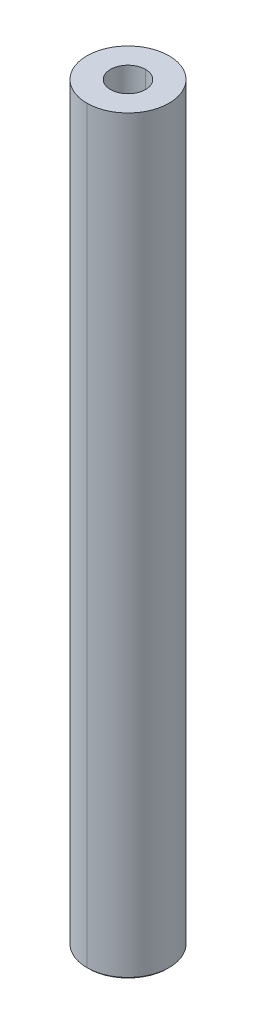
ISO-10303-21;
HEADER;
FILE_DESCRIPTION(('STEP AP214'),'2;1');
FILE_NAME('part.step','',(''),(''),'','','');
FILE_SCHEMA(('AUTOMOTIVE_DESIGN { 1 0 10303 214 1 1 1 1 }'));
ENDSEC;
DATA;
#1=APPLICATION_CONTEXT('core data for automotive mechanical design processes');
#2=APPLICATION_PROTOCOL_DEFINITION('international standard','automotive_design',2000,#1);
#3=PRODUCT_CONTEXT('',#1,'mechanical');
#4=PRODUCT('Part','Part','',(#3));
#5=PRODUCT_RELATED_PRODUCT_CATEGORY('part','',(#4));
#6=PRODUCT_DEFINITION_FORMATION('','',#4);
#7=PRODUCT_DEFINITION_CONTEXT('part definition',#1,'design');
#8=PRODUCT_DEFINITION('design','',#6,#7);
#9=PRODUCT_DEFINITION_SHAPE('','',#8);
#10=(LENGTH_UNIT() NAMED_UNIT(*) SI_UNIT(.MILLI.,.METRE.));
#11=(NAMED_UNIT(*) PLANE_ANGLE_UNIT() SI_UNIT($,.RADIAN.));
#12=(NAMED_UNIT(*) SI_UNIT($,.STERADIAN.) SOLID_ANGLE_UNIT());
#13=UNCERTAINTY_MEASURE_WITH_UNIT(LENGTH_MEASURE(1.E-05),#10,'distance_accuracy_value','');
#14=(GEOMETRIC_REPRESENTATION_CONTEXT(3) GLOBAL_UNCERTAINTY_ASSIGNED_CONTEXT((#13)) GLOBAL_UNIT_ASSIGNED_CONTEXT((#10,
#11,#12)) REPRESENTATION_CONTEXT('',''));
#15=CARTESIAN_POINT('',(0.,0.,0.));
#16=DIRECTION('',(0.,0.,1.));
#17=DIRECTION('',(1.,0.,0.));
#18=AXIS2_PLACEMENT_3D('',#15,#16,#17);
#19=CARTESIAN_POINT('',(0.,63.5,0.));
#20=DIRECTION('',(0.,-1.,0.));
#21=DIRECTION('',(0.,0.,-1.));
#22=AXIS2_PLACEMENT_3D('',#19,#20,#21);
#23=CYLINDRICAL_SURFACE('',#22,3.17119);
#24=DIRECTION('',(0.,-1.,0.));
#25=VECTOR('',#24,1.);
#26=CARTESIAN_POINT('',(0.,63.5,-3.17119));
#27=LINE('',#26,#25);
#28=CARTESIAN_POINT('',(0.,57.94,-3.17119));
#29=VERTEX_POINT('',#28);
#30=CARTESIAN_POINT('',(0.,0.127000000000002,-3.17119));
#31=VERTEX_POINT('',#30);
#32=EDGE_CURVE('E191',#29,#31,#27,.T.);
#33=ORIENTED_EDGE('',*,*,#32,.F.);
#34=CARTESIAN_POINT('',(0.,57.94,0.));
#35=DIRECTION('',(0.,1.,0.));
#36=DIRECTION('',(0.,0.,1.));
#37=AXIS2_PLACEMENT_3D('',#34,#35,#36);
#38=CIRCLE('',#37,3.17119);
#39=CARTESIAN_POINT('',(0.,57.94,3.17119));
#40=VERTEX_POINT('',#39);
#41=EDGE_CURVE('E52',#29,#40,#38,.F.);
#42=ORIENTED_EDGE('',*,*,#41,.T.);
#43=DIRECTION('',(0.,-1.,0.));
#44=VECTOR('',#43,1.);
#45=CARTESIAN_POINT('',(0.,63.5,3.17119));
#46=LINE('',#45,#44);
#47=CARTESIAN_POINT('',(0.,0.127000000000002,3.17119));
#48=VERTEX_POINT('',#47);
#49=EDGE_CURVE('E147',#40,#48,#46,.T.);
#50=ORIENTED_EDGE('',*,*,#49,.T.);
#51=CARTESIAN_POINT('',(0.,0.127000000000002,0.));
#52=DIRECTION('',(0.,1.,0.));
#53=DIRECTION('',(0.,0.,1.));
#54=AXIS2_PLACEMENT_3D('',#51,#52,#53);
#55=CIRCLE('',#54,3.17119);
#56=EDGE_CURVE('E141',#48,#31,#55,.T.);
#57=ORIENTED_EDGE('',*,*,#56,.T.);
#58=EDGE_LOOP('',(#33,#42,#50,#57));
#59=FACE_BOUND('',#58,.T.);
#60=ADVANCED_FACE('F38',(#59),#23,.T.);
#61=CARTESIAN_POINT('',(0.,63.5,0.));
#62=DIRECTION('',(0.,-1.,0.));
#63=DIRECTION('',(0.,0.,-1.));
#64=AXIS2_PLACEMENT_3D('',#61,#62,#63);
#65=CYLINDRICAL_SURFACE('',#64,3.17119);
#66=ORIENTED_EDGE('',*,*,#49,.F.);
#67=CARTESIAN_POINT('',(0.,57.94,0.));
#68=DIRECTION('',(0.,1.,0.));
#69=DIRECTION('',(0.,0.,1.));
#70=AXIS2_PLACEMENT_3D('',#67,#68,#69);
#71=CIRCLE('',#70,3.17119);
#72=EDGE_CURVE('E120',#40,#29,#71,.F.);
#73=ORIENTED_EDGE('',*,*,#72,.T.);
#74=ORIENTED_EDGE('',*,*,#32,.T.);
#75=CARTESIAN_POINT('',(0.,0.127000000000002,0.));
#76=DIRECTION('',(0.,1.,0.));
#77=DIRECTION('',(0.,0.,1.));
#78=AXIS2_PLACEMENT_3D('',#75,#76,#77);
#79=CIRCLE('',#78,3.17119);
#80=EDGE_CURVE('E184',#31,#48,#79,.T.);
#81=ORIENTED_EDGE('',*,*,#80,.T.);
#82=EDGE_LOOP('',(#66,#73,#74,#81));
#83=FACE_BOUND('',#82,.T.);
#84=ADVANCED_FACE('F211',(#83),#65,.T.);
#85=CARTESIAN_POINT('',(0.,0.,0.));
#86=DIRECTION('',(0.,-1.,0.));
#87=DIRECTION('',(0.,0.,-1.));
#88=AXIS2_PLACEMENT_3D('',#85,#86,#87);
#89=CYLINDRICAL_SURFACE('',#88,1.35255);
#90=CARTESIAN_POINT('',(0.,8.636,0.));
#91=DIRECTION('',(0.,-1.,0.));
#92=DIRECTION('',(0.,0.,-1.));
#93=AXIS2_PLACEMENT_3D('',#90,#91,#92);
#94=CIRCLE('',#93,1.35255);
#95=CARTESIAN_POINT('',(0.,8.636,1.35255));
#96=VERTEX_POINT('',#95);
#97=CARTESIAN_POINT('',(0.,8.636,-1.35255));
#98=VERTEX_POINT('',#97);
#99=EDGE_CURVE('E153',#96,#98,#94,.T.);
#100=ORIENTED_EDGE('',*,*,#99,.F.);
#101=DIRECTION('',(0.,-1.,0.));
#102=VECTOR('',#101,1.);
#103=CARTESIAN_POINT('',(0.,0.,1.35255));
#104=LINE('',#103,#102);
#105=CARTESIAN_POINT('',(0.,0.,1.35255));
#106=VERTEX_POINT('',#105);
#107=EDGE_CURVE('E46',#96,#106,#104,.T.);
#108=ORIENTED_EDGE('',*,*,#107,.T.);
#109=CARTESIAN_POINT('',(0.,0.,0.));
#110=DIRECTION('',(0.,-1.,0.));
#111=DIRECTION('',(0.,0.,-1.));
#112=AXIS2_PLACEMENT_3D('',#109,#110,#111);
#113=CIRCLE('',#112,1.35255);
#114=CARTESIAN_POINT('',(0.,0.,-1.35255));
#115=VERTEX_POINT('',#114);
#116=EDGE_CURVE('E152',#106,#115,#113,.T.);
#117=ORIENTED_EDGE('',*,*,#116,.T.);
#118=DIRECTION('',(0.,-1.,0.));
#119=VECTOR('',#118,1.);
#120=CARTESIAN_POINT('',(0.,0.,-1.35255));
#121=LINE('',#120,#119);
#122=EDGE_CURVE('E174',#98,#115,#121,.T.);
#123=ORIENTED_EDGE('',*,*,#122,.F.);
#124=EDGE_LOOP('',(#100,#108,#117,#123));
#125=FACE_BOUND('',#124,.T.);
#126=ADVANCED_FACE('F230',(#125),#89,.F.);
#127=CARTESIAN_POINT('',(0.,8.636,0.));
#128=DIRECTION('',(0.,-1.,0.));
#129=DIRECTION('',(0.,0.,-1.));
#130=AXIS2_PLACEMENT_3D('',#127,#128,#129);
#131=CONICAL_SURFACE('',#130,1.35255,1.02974425867665);
#132=DIRECTION('',(0.,-0.515038074910056,-0.857167300702111));
#133=VECTOR('',#132,1.);
#134=CARTESIAN_POINT('',(0.,8.636,-1.35255));
#135=LINE('',#134,#133);
#136=CARTESIAN_POINT('',(0.,9.44869403026573,0.));
#137=VERTEX_POINT('',#136);
#138=EDGE_CURVE('E137',#137,#98,#135,.T.);
#139=ORIENTED_EDGE('',*,*,#138,.F.);
#140=DIRECTION('',(0.,-0.515038074910056,0.857167300702111));
#141=VECTOR('',#140,1.);
#142=CARTESIAN_POINT('',(0.,8.636,1.35255));
#143=LINE('',#142,#141);
#144=EDGE_CURVE('E148',#137,#96,#143,.T.);
#145=ORIENTED_EDGE('',*,*,#144,.T.);
#146=ORIENTED_EDGE('',*,*,#99,.T.);
#147=EDGE_LOOP('',(#139,#145,#146));
#148=FACE_BOUND('',#147,.T.);
#149=ADVANCED_FACE('F233',(#148),#131,.F.);
#150=CARTESIAN_POINT('',(0.,0.127000000000002,0.));
#151=DIRECTION('',(0.,1.,0.));
#152=DIRECTION('',(0.,0.,1.));
#153=AXIS2_PLACEMENT_3D('',#150,#151,#152);
#154=CONICAL_SURFACE('',#153,3.17119,0.785398163397462);
#155=CARTESIAN_POINT('',(0.,0.,0.));
#156=DIRECTION('',(0.,-1.,0.));
#157=DIRECTION('',(0.,0.,1.));
#158=AXIS2_PLACEMENT_3D('',#155,#156,#157);
#159=CIRCLE('',#158,3.04419);
#160=CARTESIAN_POINT('',(0.,0.,-3.04419));
#161=VERTEX_POINT('',#160);
#162=CARTESIAN_POINT('',(0.,0.,3.04419));
#163=VERTEX_POINT('',#162);
#164=EDGE_CURVE('E156',#161,#163,#159,.T.);
#165=ORIENTED_EDGE('',*,*,#164,.F.);
#166=DIRECTION('',(0.,0.707106781186538,-0.707106781186557));
#167=VECTOR('',#166,1.);
#168=CARTESIAN_POINT('',(0.,0.127000000000002,-3.17119));
#169=LINE('',#168,#167);
#170=EDGE_CURVE('E160',#161,#31,#169,.T.);
#171=ORIENTED_EDGE('',*,*,#170,.T.);
#172=ORIENTED_EDGE('',*,*,#56,.F.);
#173=DIRECTION('',(0.,0.707106781186538,0.707106781186557));
#174=VECTOR('',#173,1.);
#175=CARTESIAN_POINT('',(0.,0.127000000000002,3.17119));
#176=LINE('',#175,#174);
#177=EDGE_CURVE('E127',#163,#48,#176,.T.);
#178=ORIENTED_EDGE('',*,*,#177,.F.);
#179=EDGE_LOOP('',(#165,#171,#172,#178));
#180=FACE_BOUND('',#179,.T.);
#181=ADVANCED_FACE('F217',(#180),#154,.T.);
#182=CARTESIAN_POINT('',(0.,0.,0.));
#183=DIRECTION('',(0.,1.,0.));
#184=DIRECTION('',(1.,0.,0.));
#185=AXIS2_PLACEMENT_3D('',#182,#183,#184);
#186=PLANE('',#185);
#187=CARTESIAN_POINT('',(0.,0.,0.));
#188=DIRECTION('',(0.,-1.,0.));
#189=DIRECTION('',(0.,0.,1.));
#190=AXIS2_PLACEMENT_3D('',#187,#188,#189);
#191=CIRCLE('',#190,3.04419);
#192=EDGE_CURVE('E179',#163,#161,#191,.T.);
#193=ORIENTED_EDGE('',*,*,#192,.T.);
#194=ORIENTED_EDGE('',*,*,#164,.T.);
#195=EDGE_LOOP('',(#193,#194));
#196=FACE_BOUND('',#195,.T.);
#197=CARTESIAN_POINT('',(0.,0.,0.));
#198=DIRECTION('',(0.,-1.,0.));
#199=DIRECTION('',(0.,0.,-1.));
#200=AXIS2_PLACEMENT_3D('',#197,#198,#199);
#201=CIRCLE('',#200,1.35255);
#202=EDGE_CURVE('E170',#115,#106,#201,.T.);
#203=ORIENTED_EDGE('',*,*,#202,.F.);
#204=ORIENTED_EDGE('',*,*,#116,.F.);
#205=EDGE_LOOP('',(#203,#204));
#206=FACE_BOUND('',#205,.T.);
#207=ADVANCED_FACE('F220',(#196,#206),#186,.F.);
#208=CARTESIAN_POINT('',(0.,0.127000000000002,0.));
#209=DIRECTION('',(0.,1.,0.));
#210=DIRECTION('',(0.,0.,1.));
#211=AXIS2_PLACEMENT_3D('',#208,#209,#210);
#212=CONICAL_SURFACE('',#211,3.17119,0.785398163397462);
#213=ORIENTED_EDGE('',*,*,#170,.F.);
#214=ORIENTED_EDGE('',*,*,#192,.F.);
#215=ORIENTED_EDGE('',*,*,#177,.T.);
#216=ORIENTED_EDGE('',*,*,#80,.F.);
#217=EDGE_LOOP('',(#213,#214,#215,#216));
#218=FACE_BOUND('',#217,.T.);
#219=ADVANCED_FACE('F219',(#218),#212,.T.);
#220=CARTESIAN_POINT('',(0.,8.636,0.));
#221=DIRECTION('',(0.,-1.,0.));
#222=DIRECTION('',(0.,0.,-1.));
#223=AXIS2_PLACEMENT_3D('',#220,#221,#222);
#224=CONICAL_SURFACE('',#223,1.35255,1.02974425867665);
#225=ORIENTED_EDGE('',*,*,#144,.F.);
#226=ORIENTED_EDGE('',*,*,#138,.T.);
#227=CARTESIAN_POINT('',(0.,8.636,0.));
#228=DIRECTION('',(0.,-1.,0.));
#229=DIRECTION('',(0.,0.,-1.));
#230=AXIS2_PLACEMENT_3D('',#227,#228,#229);
#231=CIRCLE('',#230,1.35255);
#232=EDGE_CURVE('E181',#98,#96,#231,.T.);
#233=ORIENTED_EDGE('',*,*,#232,.T.);
#234=EDGE_LOOP('',(#225,#226,#233));
#235=FACE_BOUND('',#234,.T.);
#236=ADVANCED_FACE('F235',(#235),#224,.F.);
#237=CARTESIAN_POINT('',(0.,0.,0.));
#238=DIRECTION('',(0.,-1.,0.));
#239=DIRECTION('',(0.,0.,-1.));
#240=AXIS2_PLACEMENT_3D('',#237,#238,#239);
#241=CYLINDRICAL_SURFACE('',#240,1.35255);
#242=ORIENTED_EDGE('',*,*,#107,.F.);
#243=ORIENTED_EDGE('',*,*,#232,.F.);
#244=ORIENTED_EDGE('',*,*,#122,.T.);
#245=ORIENTED_EDGE('',*,*,#202,.T.);
#246=EDGE_LOOP('',(#242,#243,#244,#245));
#247=FACE_BOUND('',#246,.T.);
#248=ADVANCED_FACE('F227',(#247),#241,.F.);
#249=CARTESIAN_POINT('',(0.,57.94,0.));
#250=DIRECTION('',(0.,1.,0.));
#251=DIRECTION('',(0.,0.,1.));
#252=AXIS2_PLACEMENT_3D('',#249,#250,#251);
#253=PLANE('',#252);
#254=ORIENTED_EDGE('',*,*,#72,.F.);
#255=ORIENTED_EDGE('',*,*,#41,.F.);
#256=EDGE_LOOP('',(#254,#255));
#257=FACE_BOUND('',#256,.T.);
#258=CARTESIAN_POINT('',(0.,57.94,0.));
#259=DIRECTION('',(0.,1.,0.));
#260=DIRECTION('',(0.,0.,1.));
#261=AXIS2_PLACEMENT_3D('',#258,#259,#260);
#262=CIRCLE('',#261,1.35255);
#263=CARTESIAN_POINT('',(0.,57.94,1.35255));
#264=VERTEX_POINT('',#263);
#265=CARTESIAN_POINT('',(0.,57.94,-1.35255));
#266=VERTEX_POINT('',#265);
#267=EDGE_CURVE('E58',#264,#266,#262,.F.);
#268=ORIENTED_EDGE('',*,*,#267,.T.);
#269=CARTESIAN_POINT('',(0.,57.94,0.));
#270=DIRECTION('',(0.,1.,0.));
#271=DIRECTION('',(0.,0.,1.));
#272=AXIS2_PLACEMENT_3D('',#269,#270,#271);
#273=CIRCLE('',#272,1.35255);
#274=EDGE_CURVE('E11',#266,#264,#273,.F.);
#275=ORIENTED_EDGE('',*,*,#274,.T.);
#276=EDGE_LOOP('',(#268,#275));
#277=FACE_BOUND('',#276,.T.);
#278=ADVANCED_FACE('F111',(#257,#277),#253,.T.);
#279=CARTESIAN_POINT('',(0.,54.864,0.));
#280=DIRECTION('',(0.,1.,0.));
#281=DIRECTION('',(0.,0.,1.));
#282=AXIS2_PLACEMENT_3D('',#279,#280,#281);
#283=CONICAL_SURFACE('',#282,1.35255,1.02974425867665);
#284=DIRECTION('',(0.,0.515038074910058,0.85716730070211));
#285=VECTOR('',#284,1.);
#286=CARTESIAN_POINT('',(0.,54.864,1.35255));
#287=LINE('',#286,#285);
#288=CARTESIAN_POINT('',(0.,54.0513059697343,0.));
#289=VERTEX_POINT('',#288);
#290=CARTESIAN_POINT('',(0.,54.864,1.35255));
#291=VERTEX_POINT('',#290);
#292=EDGE_CURVE('E133',#289,#291,#287,.T.);
#293=ORIENTED_EDGE('',*,*,#292,.F.);
#294=DIRECTION('',(0.,0.515038074910058,-0.85716730070211));
#295=VECTOR('',#294,1.);
#296=CARTESIAN_POINT('',(0.,54.864,-1.35255));
#297=LINE('',#296,#295);
#298=CARTESIAN_POINT('',(0.,54.864,-1.35255));
#299=VERTEX_POINT('',#298);
#300=EDGE_CURVE('E146',#289,#299,#297,.T.);
#301=ORIENTED_EDGE('',*,*,#300,.T.);
#302=CARTESIAN_POINT('',(0.,54.864,0.));
#303=DIRECTION('',(0.,1.,0.));
#304=DIRECTION('',(0.,0.,1.));
#305=AXIS2_PLACEMENT_3D('',#302,#303,#304);
#306=CIRCLE('',#305,1.35255);
#307=EDGE_CURVE('E143',#299,#291,#306,.T.);
#308=ORIENTED_EDGE('',*,*,#307,.T.);
#309=EDGE_LOOP('',(#293,#301,#308));
#310=FACE_BOUND('',#309,.T.);
#311=ADVANCED_FACE('F254',(#310),#283,.F.);
#312=CARTESIAN_POINT('',(0.,54.864,0.));
#313=DIRECTION('',(0.,1.,0.));
#314=DIRECTION('',(0.,0.,1.));
#315=AXIS2_PLACEMENT_3D('',#312,#313,#314);
#316=CONICAL_SURFACE('',#315,1.35255,1.02974425867665);
#317=ORIENTED_EDGE('',*,*,#300,.F.);
#318=ORIENTED_EDGE('',*,*,#292,.T.);
#319=CARTESIAN_POINT('',(0.,54.864,0.));
#320=DIRECTION('',(0.,1.,0.));
#321=DIRECTION('',(0.,0.,1.));
#322=AXIS2_PLACEMENT_3D('',#319,#320,#321);
#323=CIRCLE('',#322,1.35255);
#324=EDGE_CURVE('E125',#291,#299,#323,.T.);
#325=ORIENTED_EDGE('',*,*,#324,.T.);
#326=EDGE_LOOP('',(#317,#318,#325));
#327=FACE_BOUND('',#326,.T.);
#328=ADVANCED_FACE('F258',(#327),#316,.F.);
#329=CARTESIAN_POINT('',(0.,63.5,0.));
#330=DIRECTION('',(0.,1.,0.));
#331=DIRECTION('',(0.,0.,1.));
#332=AXIS2_PLACEMENT_3D('',#329,#330,#331);
#333=CYLINDRICAL_SURFACE('',#332,1.35255);
#334=ORIENTED_EDGE('',*,*,#274,.F.);
#335=DIRECTION('',(0.,1.,0.));
#336=VECTOR('',#335,1.);
#337=CARTESIAN_POINT('',(0.,63.5,-1.35255));
#338=LINE('',#337,#336);
#339=EDGE_CURVE('E119',#299,#266,#338,.T.);
#340=ORIENTED_EDGE('',*,*,#339,.F.);
#341=ORIENTED_EDGE('',*,*,#324,.F.);
#342=DIRECTION('',(0.,1.,0.));
#343=VECTOR('',#342,1.);
#344=CARTESIAN_POINT('',(0.,63.5,1.35255));
#345=LINE('',#344,#343);
#346=EDGE_CURVE('E117',#291,#264,#345,.T.);
#347=ORIENTED_EDGE('',*,*,#346,.T.);
#348=EDGE_LOOP('',(#334,#340,#341,#347));
#349=FACE_BOUND('',#348,.T.);
#350=ADVANCED_FACE('F123',(#349),#333,.F.);
#351=CARTESIAN_POINT('',(0.,63.5,0.));
#352=DIRECTION('',(0.,1.,0.));
#353=DIRECTION('',(0.,0.,1.));
#354=AXIS2_PLACEMENT_3D('',#351,#352,#353);
#355=CYLINDRICAL_SURFACE('',#354,1.35255);
#356=ORIENTED_EDGE('',*,*,#267,.F.);
#357=ORIENTED_EDGE('',*,*,#346,.F.);
#358=ORIENTED_EDGE('',*,*,#307,.F.);
#359=ORIENTED_EDGE('',*,*,#339,.T.);
#360=EDGE_LOOP('',(#356,#357,#358,#359));
#361=FACE_BOUND('',#360,.T.);
#362=ADVANCED_FACE('F40',(#361),#355,.F.);
#363=CLOSED_SHELL('',(#60,#84,#126,#149,#181,#207,#219,#236,#248,#278,#311,#328,#350,#362));
#364=MANIFOLD_SOLID_BREP('B2',#363);
#365=ADVANCED_BREP_SHAPE_REPRESENTATION('',(#18,#364),#14);
#366=SHAPE_DEFINITION_REPRESENTATION(#9,#365);
ENDSEC;
END-ISO-10303-21;
